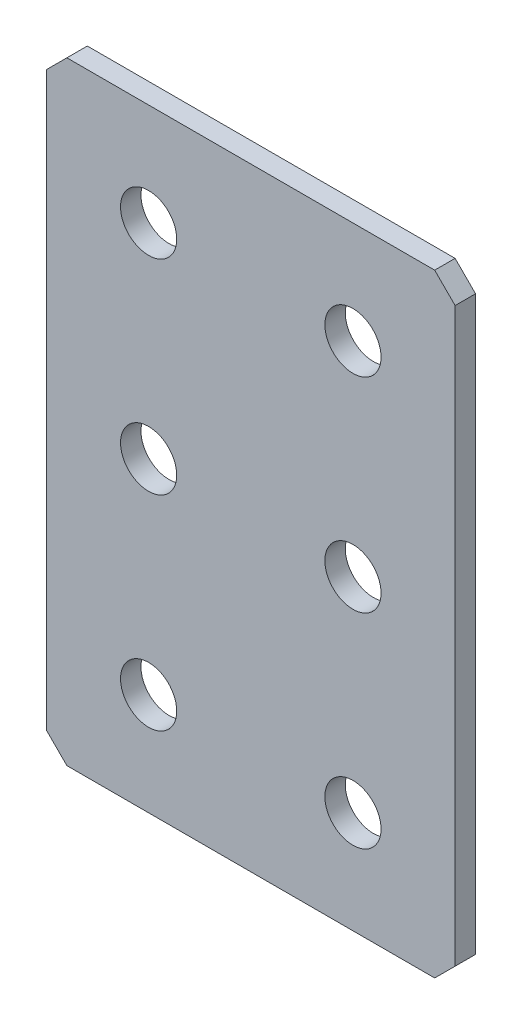
ISO-10303-21;
HEADER;
FILE_DESCRIPTION(('STEP AP214'),'2;1');
FILE_NAME('part.step','',(''),(''),'','','');
FILE_SCHEMA(('AUTOMOTIVE_DESIGN { 1 0 10303 214 1 1 1 1 }'));
ENDSEC;
DATA;
#1=APPLICATION_CONTEXT('core data for automotive mechanical design processes');
#2=APPLICATION_PROTOCOL_DEFINITION('international standard','automotive_design',2000,#1);
#3=PRODUCT_CONTEXT('',#1,'mechanical');
#4=PRODUCT('Part','Part','',(#3));
#5=PRODUCT_RELATED_PRODUCT_CATEGORY('part','',(#4));
#6=PRODUCT_DEFINITION_FORMATION('','',#4);
#7=PRODUCT_DEFINITION_CONTEXT('part definition',#1,'design');
#8=PRODUCT_DEFINITION('design','',#6,#7);
#9=PRODUCT_DEFINITION_SHAPE('','',#8);
#10=(LENGTH_UNIT() NAMED_UNIT(*) SI_UNIT(.MILLI.,.METRE.));
#11=(NAMED_UNIT(*) PLANE_ANGLE_UNIT() SI_UNIT($,.RADIAN.));
#12=(NAMED_UNIT(*) SI_UNIT($,.STERADIAN.) SOLID_ANGLE_UNIT());
#13=UNCERTAINTY_MEASURE_WITH_UNIT(LENGTH_MEASURE(1.E-05),#10,'distance_accuracy_value','');
#14=(GEOMETRIC_REPRESENTATION_CONTEXT(3) GLOBAL_UNCERTAINTY_ASSIGNED_CONTEXT((#13)) GLOBAL_UNIT_ASSIGNED_CONTEXT((#10,
#11,#12)) REPRESENTATION_CONTEXT('',''));
#15=CARTESIAN_POINT('',(0.,0.,0.));
#16=DIRECTION('',(0.,0.,1.));
#17=DIRECTION('',(1.,0.,0.));
#18=AXIS2_PLACEMENT_3D('',#15,#16,#17);
#19=CARTESIAN_POINT('',(20.,-30.,2.));
#20=DIRECTION('',(-1.,0.,0.));
#21=DIRECTION('',(0.,0.,1.));
#22=AXIS2_PLACEMENT_3D('',#19,#20,#21);
#23=PLANE('',#22);
#24=DIRECTION('',(0.,1.,0.));
#25=VECTOR('',#24,1.);
#26=CARTESIAN_POINT('',(20.,-30.,2.));
#27=LINE('',#26,#25);
#28=CARTESIAN_POINT('',(20.,-28.,2.));
#29=VERTEX_POINT('',#28);
#30=CARTESIAN_POINT('',(20.,28.,2.));
#31=VERTEX_POINT('',#30);
#32=EDGE_CURVE('E127',#29,#31,#27,.T.);
#33=ORIENTED_EDGE('',*,*,#32,.F.);
#34=DIRECTION('',(0.,0.,-1.));
#35=VECTOR('',#34,1.);
#36=CARTESIAN_POINT('',(20.,-28.,2.));
#37=LINE('',#36,#35);
#38=CARTESIAN_POINT('',(20.,-28.,0.));
#39=VERTEX_POINT('',#38);
#40=EDGE_CURVE('E153',#29,#39,#37,.T.);
#41=ORIENTED_EDGE('',*,*,#40,.T.);
#42=DIRECTION('',(0.,1.,0.));
#43=VECTOR('',#42,1.);
#44=CARTESIAN_POINT('',(20.,-30.,0.));
#45=LINE('',#44,#43);
#46=CARTESIAN_POINT('',(20.,28.,0.));
#47=VERTEX_POINT('',#46);
#48=EDGE_CURVE('E161',#39,#47,#45,.T.);
#49=ORIENTED_EDGE('',*,*,#48,.T.);
#50=DIRECTION('',(0.,0.,1.));
#51=VECTOR('',#50,1.);
#52=CARTESIAN_POINT('',(20.,28.,2.));
#53=LINE('',#52,#51);
#54=EDGE_CURVE('E151',#47,#31,#53,.T.);
#55=ORIENTED_EDGE('',*,*,#54,.T.);
#56=EDGE_LOOP('',(#33,#41,#49,#55));
#57=FACE_BOUND('',#56,.T.);
#58=ADVANCED_FACE('F36',(#57),#23,.F.);
#59=CARTESIAN_POINT('',(-20.,30.,2.));
#60=DIRECTION('',(0.,-1.,0.));
#61=DIRECTION('',(0.,0.,-1.));
#62=AXIS2_PLACEMENT_3D('',#59,#60,#61);
#63=PLANE('',#62);
#64=DIRECTION('',(-1.,0.,0.));
#65=VECTOR('',#64,1.);
#66=CARTESIAN_POINT('',(-20.,30.,0.));
#67=LINE('',#66,#65);
#68=CARTESIAN_POINT('',(18.,30.,0.));
#69=VERTEX_POINT('',#68);
#70=CARTESIAN_POINT('',(-18.,30.,0.));
#71=VERTEX_POINT('',#70);
#72=EDGE_CURVE('E132',#69,#71,#67,.T.);
#73=ORIENTED_EDGE('',*,*,#72,.T.);
#74=DIRECTION('',(0.,0.,1.));
#75=VECTOR('',#74,1.);
#76=CARTESIAN_POINT('',(-18.,30.,2.));
#77=LINE('',#76,#75);
#78=CARTESIAN_POINT('',(-18.,30.,2.));
#79=VERTEX_POINT('',#78);
#80=EDGE_CURVE('E11',#71,#79,#77,.T.);
#81=ORIENTED_EDGE('',*,*,#80,.T.);
#82=DIRECTION('',(-1.,0.,0.));
#83=VECTOR('',#82,1.);
#84=CARTESIAN_POINT('',(-20.,30.,2.));
#85=LINE('',#84,#83);
#86=CARTESIAN_POINT('',(18.,30.,2.));
#87=VERTEX_POINT('',#86);
#88=EDGE_CURVE('E130',#87,#79,#85,.T.);
#89=ORIENTED_EDGE('',*,*,#88,.F.);
#90=DIRECTION('',(0.,0.,-1.));
#91=VECTOR('',#90,1.);
#92=CARTESIAN_POINT('',(18.,30.,2.));
#93=LINE('',#92,#91);
#94=EDGE_CURVE('E44',#87,#69,#93,.T.);
#95=ORIENTED_EDGE('',*,*,#94,.T.);
#96=EDGE_LOOP('',(#73,#81,#89,#95));
#97=FACE_BOUND('',#96,.T.);
#98=ADVANCED_FACE('F158',(#97),#63,.F.);
#99=CARTESIAN_POINT('',(-20.,-30.,2.));
#100=DIRECTION('',(1.,0.,0.));
#101=DIRECTION('',(0.,0.,-1.));
#102=AXIS2_PLACEMENT_3D('',#99,#100,#101);
#103=PLANE('',#102);
#104=DIRECTION('',(0.,-1.,0.));
#105=VECTOR('',#104,1.);
#106=CARTESIAN_POINT('',(-20.,-30.,0.));
#107=LINE('',#106,#105);
#108=CARTESIAN_POINT('',(-20.,28.,0.));
#109=VERTEX_POINT('',#108);
#110=CARTESIAN_POINT('',(-20.,-28.,0.));
#111=VERTEX_POINT('',#110);
#112=EDGE_CURVE('E128',#109,#111,#107,.T.);
#113=ORIENTED_EDGE('',*,*,#112,.T.);
#114=DIRECTION('',(0.,0.,1.));
#115=VECTOR('',#114,1.);
#116=CARTESIAN_POINT('',(-20.,-28.,2.));
#117=LINE('',#116,#115);
#118=CARTESIAN_POINT('',(-20.,-28.,2.));
#119=VERTEX_POINT('',#118);
#120=EDGE_CURVE('E106',#111,#119,#117,.T.);
#121=ORIENTED_EDGE('',*,*,#120,.T.);
#122=DIRECTION('',(0.,-1.,0.));
#123=VECTOR('',#122,1.);
#124=CARTESIAN_POINT('',(-20.,-30.,2.));
#125=LINE('',#124,#123);
#126=CARTESIAN_POINT('',(-20.,28.,2.));
#127=VERTEX_POINT('',#126);
#128=EDGE_CURVE('E166',#127,#119,#125,.T.);
#129=ORIENTED_EDGE('',*,*,#128,.F.);
#130=DIRECTION('',(0.,0.,-1.));
#131=VECTOR('',#130,1.);
#132=CARTESIAN_POINT('',(-20.,28.,2.));
#133=LINE('',#132,#131);
#134=EDGE_CURVE('E111',#127,#109,#133,.T.);
#135=ORIENTED_EDGE('',*,*,#134,.T.);
#136=EDGE_LOOP('',(#113,#121,#129,#135));
#137=FACE_BOUND('',#136,.T.);
#138=ADVANCED_FACE('F225',(#137),#103,.F.);
#139=CARTESIAN_POINT('',(-20.,-30.,2.));
#140=DIRECTION('',(0.,1.,0.));
#141=DIRECTION('',(0.,0.,1.));
#142=AXIS2_PLACEMENT_3D('',#139,#140,#141);
#143=PLANE('',#142);
#144=DIRECTION('',(1.,0.,0.));
#145=VECTOR('',#144,1.);
#146=CARTESIAN_POINT('',(-20.,-30.,2.));
#147=LINE('',#146,#145);
#148=CARTESIAN_POINT('',(-18.,-30.,2.));
#149=VERTEX_POINT('',#148);
#150=CARTESIAN_POINT('',(18.,-30.,2.));
#151=VERTEX_POINT('',#150);
#152=EDGE_CURVE('E121',#149,#151,#147,.T.);
#153=ORIENTED_EDGE('',*,*,#152,.F.);
#154=DIRECTION('',(0.,0.,-1.));
#155=VECTOR('',#154,1.);
#156=CARTESIAN_POINT('',(-18.,-30.,2.));
#157=LINE('',#156,#155);
#158=CARTESIAN_POINT('',(-18.,-30.,0.));
#159=VERTEX_POINT('',#158);
#160=EDGE_CURVE('E105',#149,#159,#157,.T.);
#161=ORIENTED_EDGE('',*,*,#160,.T.);
#162=DIRECTION('',(1.,0.,0.));
#163=VECTOR('',#162,1.);
#164=CARTESIAN_POINT('',(-20.,-30.,0.));
#165=LINE('',#164,#163);
#166=CARTESIAN_POINT('',(18.,-30.,0.));
#167=VERTEX_POINT('',#166);
#168=EDGE_CURVE('E118',#159,#167,#165,.T.);
#169=ORIENTED_EDGE('',*,*,#168,.T.);
#170=DIRECTION('',(0.,0.,1.));
#171=VECTOR('',#170,1.);
#172=CARTESIAN_POINT('',(18.,-30.,2.));
#173=LINE('',#172,#171);
#174=EDGE_CURVE('E123',#167,#151,#173,.T.);
#175=ORIENTED_EDGE('',*,*,#174,.T.);
#176=EDGE_LOOP('',(#153,#161,#169,#175));
#177=FACE_BOUND('',#176,.T.);
#178=ADVANCED_FACE('F117',(#177),#143,.F.);
#179=CARTESIAN_POINT('',(0.,0.,2.));
#180=DIRECTION('',(0.,0.,-1.));
#181=DIRECTION('',(-1.,0.,0.));
#182=AXIS2_PLACEMENT_3D('',#179,#180,#181);
#183=PLANE('',#182);
#184=CARTESIAN_POINT('',(-10.,20.,2.));
#185=DIRECTION('',(0.,0.,1.));
#186=DIRECTION('',(1.,0.,0.));
#187=AXIS2_PLACEMENT_3D('',#184,#185,#186);
#188=CIRCLE('',#187,2.75);
#189=CARTESIAN_POINT('',(-7.25,20.,2.));
#190=VERTEX_POINT('',#189);
#191=EDGE_CURVE('E202',#190,#190,#188,.T.);
#192=ORIENTED_EDGE('',*,*,#191,.F.);
#193=EDGE_LOOP('',(#192));
#194=FACE_BOUND('',#193,.T.);
#195=CARTESIAN_POINT('',(10.,20.,2.));
#196=DIRECTION('',(0.,0.,1.));
#197=DIRECTION('',(1.,0.,0.));
#198=AXIS2_PLACEMENT_3D('',#195,#196,#197);
#199=CIRCLE('',#198,2.75);
#200=CARTESIAN_POINT('',(12.75,20.,2.));
#201=VERTEX_POINT('',#200);
#202=EDGE_CURVE('E196',#201,#201,#199,.T.);
#203=ORIENTED_EDGE('',*,*,#202,.F.);
#204=EDGE_LOOP('',(#203));
#205=FACE_BOUND('',#204,.T.);
#206=CARTESIAN_POINT('',(10.,0.,2.));
#207=DIRECTION('',(0.,0.,1.));
#208=DIRECTION('',(1.,0.,0.));
#209=AXIS2_PLACEMENT_3D('',#206,#207,#208);
#210=CIRCLE('',#209,2.75);
#211=CARTESIAN_POINT('',(12.75,0.,2.));
#212=VERTEX_POINT('',#211);
#213=EDGE_CURVE('E190',#212,#212,#210,.T.);
#214=ORIENTED_EDGE('',*,*,#213,.F.);
#215=EDGE_LOOP('',(#214));
#216=FACE_BOUND('',#215,.T.);
#217=CARTESIAN_POINT('',(-10.,0.,2.));
#218=DIRECTION('',(0.,0.,1.));
#219=DIRECTION('',(1.,0.,0.));
#220=AXIS2_PLACEMENT_3D('',#217,#218,#219);
#221=CIRCLE('',#220,2.75);
#222=CARTESIAN_POINT('',(-7.25,0.,2.));
#223=VERTEX_POINT('',#222);
#224=EDGE_CURVE('E184',#223,#223,#221,.T.);
#225=ORIENTED_EDGE('',*,*,#224,.F.);
#226=EDGE_LOOP('',(#225));
#227=FACE_BOUND('',#226,.T.);
#228=CARTESIAN_POINT('',(-10.,-20.,2.));
#229=DIRECTION('',(0.,0.,1.));
#230=DIRECTION('',(1.,0.,0.));
#231=AXIS2_PLACEMENT_3D('',#228,#229,#230);
#232=CIRCLE('',#231,2.75);
#233=CARTESIAN_POINT('',(-7.25,-20.,2.));
#234=VERTEX_POINT('',#233);
#235=EDGE_CURVE('E178',#234,#234,#232,.T.);
#236=ORIENTED_EDGE('',*,*,#235,.F.);
#237=EDGE_LOOP('',(#236));
#238=FACE_BOUND('',#237,.T.);
#239=CARTESIAN_POINT('',(10.,-20.,2.));
#240=DIRECTION('',(0.,0.,1.));
#241=DIRECTION('',(1.,0.,0.));
#242=AXIS2_PLACEMENT_3D('',#239,#240,#241);
#243=CIRCLE('',#242,2.75);
#244=CARTESIAN_POINT('',(12.75,-20.,2.));
#245=VERTEX_POINT('',#244);
#246=EDGE_CURVE('E172',#245,#245,#243,.T.);
#247=ORIENTED_EDGE('',*,*,#246,.F.);
#248=EDGE_LOOP('',(#247));
#249=FACE_BOUND('',#248,.T.);
#250=ORIENTED_EDGE('',*,*,#128,.T.);
#251=DIRECTION('',(-0.707106781186545,0.70710678118655,0.));
#252=VECTOR('',#251,1.);
#253=CARTESIAN_POINT('',(-18.,-30.,2.));
#254=LINE('',#253,#252);
#255=EDGE_CURVE('E149',#119,#149,#254,.F.);
#256=ORIENTED_EDGE('',*,*,#255,.T.);
#257=ORIENTED_EDGE('',*,*,#152,.T.);
#258=DIRECTION('',(-0.70710678118655,-0.707106781186545,0.));
#259=VECTOR('',#258,1.);
#260=CARTESIAN_POINT('',(20.,-28.,2.));
#261=LINE('',#260,#259);
#262=EDGE_CURVE('E147',#151,#29,#261,.F.);
#263=ORIENTED_EDGE('',*,*,#262,.T.);
#264=ORIENTED_EDGE('',*,*,#32,.T.);
#265=DIRECTION('',(0.707106781186545,-0.70710678118655,0.));
#266=VECTOR('',#265,1.);
#267=CARTESIAN_POINT('',(18.,30.,2.));
#268=LINE('',#267,#266);
#269=EDGE_CURVE('E56',#31,#87,#268,.F.);
#270=ORIENTED_EDGE('',*,*,#269,.T.);
#271=ORIENTED_EDGE('',*,*,#88,.T.);
#272=DIRECTION('',(0.70710678118655,0.707106781186545,0.));
#273=VECTOR('',#272,1.);
#274=CARTESIAN_POINT('',(-20.,28.,2.));
#275=LINE('',#274,#273);
#276=EDGE_CURVE('E145',#79,#127,#275,.F.);
#277=ORIENTED_EDGE('',*,*,#276,.T.);
#278=EDGE_LOOP('',(#250,#256,#257,#263,#264,#270,#271,#277));
#279=FACE_BOUND('',#278,.T.);
#280=ADVANCED_FACE('F208',(#194,#205,#216,#227,#238,#249,#279),#183,.F.);
#281=CARTESIAN_POINT('',(0.,0.,0.));
#282=DIRECTION('',(0.,0.,-1.));
#283=DIRECTION('',(-1.,0.,0.));
#284=AXIS2_PLACEMENT_3D('',#281,#282,#283);
#285=PLANE('',#284);
#286=CARTESIAN_POINT('',(-10.,20.,0.));
#287=DIRECTION('',(0.,0.,1.));
#288=DIRECTION('',(1.,0.,0.));
#289=AXIS2_PLACEMENT_3D('',#286,#287,#288);
#290=CIRCLE('',#289,2.75);
#291=CARTESIAN_POINT('',(-7.25,20.,0.));
#292=VERTEX_POINT('',#291);
#293=EDGE_CURVE('E199',#292,#292,#290,.T.);
#294=ORIENTED_EDGE('',*,*,#293,.T.);
#295=EDGE_LOOP('',(#294));
#296=FACE_BOUND('',#295,.T.);
#297=CARTESIAN_POINT('',(10.,20.,0.));
#298=DIRECTION('',(0.,0.,1.));
#299=DIRECTION('',(1.,0.,0.));
#300=AXIS2_PLACEMENT_3D('',#297,#298,#299);
#301=CIRCLE('',#300,2.75);
#302=CARTESIAN_POINT('',(12.75,20.,0.));
#303=VERTEX_POINT('',#302);
#304=EDGE_CURVE('E193',#303,#303,#301,.T.);
#305=ORIENTED_EDGE('',*,*,#304,.T.);
#306=EDGE_LOOP('',(#305));
#307=FACE_BOUND('',#306,.T.);
#308=CARTESIAN_POINT('',(10.,0.,0.));
#309=DIRECTION('',(0.,0.,1.));
#310=DIRECTION('',(1.,0.,0.));
#311=AXIS2_PLACEMENT_3D('',#308,#309,#310);
#312=CIRCLE('',#311,2.75);
#313=CARTESIAN_POINT('',(12.75,0.,0.));
#314=VERTEX_POINT('',#313);
#315=EDGE_CURVE('E187',#314,#314,#312,.T.);
#316=ORIENTED_EDGE('',*,*,#315,.T.);
#317=EDGE_LOOP('',(#316));
#318=FACE_BOUND('',#317,.T.);
#319=CARTESIAN_POINT('',(-10.,0.,0.));
#320=DIRECTION('',(0.,0.,1.));
#321=DIRECTION('',(1.,0.,0.));
#322=AXIS2_PLACEMENT_3D('',#319,#320,#321);
#323=CIRCLE('',#322,2.75);
#324=CARTESIAN_POINT('',(-7.25,0.,0.));
#325=VERTEX_POINT('',#324);
#326=EDGE_CURVE('E181',#325,#325,#323,.T.);
#327=ORIENTED_EDGE('',*,*,#326,.T.);
#328=EDGE_LOOP('',(#327));
#329=FACE_BOUND('',#328,.T.);
#330=CARTESIAN_POINT('',(-10.,-20.,0.));
#331=DIRECTION('',(0.,0.,1.));
#332=DIRECTION('',(1.,0.,0.));
#333=AXIS2_PLACEMENT_3D('',#330,#331,#332);
#334=CIRCLE('',#333,2.75);
#335=CARTESIAN_POINT('',(-7.25,-20.,0.));
#336=VERTEX_POINT('',#335);
#337=EDGE_CURVE('E175',#336,#336,#334,.T.);
#338=ORIENTED_EDGE('',*,*,#337,.T.);
#339=EDGE_LOOP('',(#338));
#340=FACE_BOUND('',#339,.T.);
#341=CARTESIAN_POINT('',(10.,-20.,0.));
#342=DIRECTION('',(0.,0.,1.));
#343=DIRECTION('',(1.,0.,0.));
#344=AXIS2_PLACEMENT_3D('',#341,#342,#343);
#345=CIRCLE('',#344,2.75);
#346=CARTESIAN_POINT('',(12.75,-20.,0.));
#347=VERTEX_POINT('',#346);
#348=EDGE_CURVE('E162',#347,#347,#345,.T.);
#349=ORIENTED_EDGE('',*,*,#348,.T.);
#350=EDGE_LOOP('',(#349));
#351=FACE_BOUND('',#350,.T.);
#352=ORIENTED_EDGE('',*,*,#168,.F.);
#353=DIRECTION('',(0.707106781186545,-0.70710678118655,0.));
#354=VECTOR('',#353,1.);
#355=CARTESIAN_POINT('',(-24.0000000000001,-23.9999999999999,0.));
#356=LINE('',#355,#354);
#357=EDGE_CURVE('E101',#159,#111,#356,.F.);
#358=ORIENTED_EDGE('',*,*,#357,.T.);
#359=ORIENTED_EDGE('',*,*,#112,.F.);
#360=DIRECTION('',(-0.70710678118655,-0.707106781186545,0.));
#361=VECTOR('',#360,1.);
#362=CARTESIAN_POINT('',(-23.9999999999999,24.0000000000001,0.));
#363=LINE('',#362,#361);
#364=EDGE_CURVE('E138',#109,#71,#363,.F.);
#365=ORIENTED_EDGE('',*,*,#364,.T.);
#366=ORIENTED_EDGE('',*,*,#72,.F.);
#367=DIRECTION('',(-0.707106781186545,0.70710678118655,0.));
#368=VECTOR('',#367,1.);
#369=CARTESIAN_POINT('',(24.0000000000001,23.9999999999999,0.));
#370=LINE('',#369,#368);
#371=EDGE_CURVE('E122',#69,#47,#370,.F.);
#372=ORIENTED_EDGE('',*,*,#371,.T.);
#373=ORIENTED_EDGE('',*,*,#48,.F.);
#374=DIRECTION('',(0.70710678118655,0.707106781186545,0.));
#375=VECTOR('',#374,1.);
#376=CARTESIAN_POINT('',(23.9999999999999,-24.0000000000001,0.));
#377=LINE('',#376,#375);
#378=EDGE_CURVE('E112',#39,#167,#377,.F.);
#379=ORIENTED_EDGE('',*,*,#378,.T.);
#380=EDGE_LOOP('',(#352,#358,#359,#365,#366,#372,#373,#379));
#381=FACE_BOUND('',#380,.T.);
#382=ADVANCED_FACE('F125',(#296,#307,#318,#329,#340,#351,#381),#285,.T.);
#383=CARTESIAN_POINT('',(-18.,-30.,2.));
#384=DIRECTION('',(0.70710678118655,0.707106781186545,0.));
#385=DIRECTION('',(0.,0.,-1.));
#386=AXIS2_PLACEMENT_3D('',#383,#384,#385);
#387=PLANE('',#386);
#388=ORIENTED_EDGE('',*,*,#255,.F.);
#389=ORIENTED_EDGE('',*,*,#120,.F.);
#390=ORIENTED_EDGE('',*,*,#357,.F.);
#391=ORIENTED_EDGE('',*,*,#160,.F.);
#392=EDGE_LOOP('',(#388,#389,#390,#391));
#393=FACE_BOUND('',#392,.T.);
#394=ADVANCED_FACE('F104',(#393),#387,.F.);
#395=CARTESIAN_POINT('',(20.,-28.,2.));
#396=DIRECTION('',(-0.707106781186545,0.70710678118655,0.));
#397=DIRECTION('',(0.,0.,-1.));
#398=AXIS2_PLACEMENT_3D('',#395,#396,#397);
#399=PLANE('',#398);
#400=ORIENTED_EDGE('',*,*,#262,.F.);
#401=ORIENTED_EDGE('',*,*,#174,.F.);
#402=ORIENTED_EDGE('',*,*,#378,.F.);
#403=ORIENTED_EDGE('',*,*,#40,.F.);
#404=EDGE_LOOP('',(#400,#401,#402,#403));
#405=FACE_BOUND('',#404,.T.);
#406=ADVANCED_FACE('F229',(#405),#399,.F.);
#407=CARTESIAN_POINT('',(-20.,28.,2.));
#408=DIRECTION('',(0.707106781186545,-0.70710678118655,0.));
#409=DIRECTION('',(0.,0.,-1.));
#410=AXIS2_PLACEMENT_3D('',#407,#408,#409);
#411=PLANE('',#410);
#412=ORIENTED_EDGE('',*,*,#276,.F.);
#413=ORIENTED_EDGE('',*,*,#80,.F.);
#414=ORIENTED_EDGE('',*,*,#364,.F.);
#415=ORIENTED_EDGE('',*,*,#134,.F.);
#416=EDGE_LOOP('',(#412,#413,#414,#415));
#417=FACE_BOUND('',#416,.T.);
#418=ADVANCED_FACE('F227',(#417),#411,.F.);
#419=CARTESIAN_POINT('',(18.,30.,2.));
#420=DIRECTION('',(-0.70710678118655,-0.707106781186545,0.));
#421=DIRECTION('',(0.,0.,-1.));
#422=AXIS2_PLACEMENT_3D('',#419,#420,#421);
#423=PLANE('',#422);
#424=ORIENTED_EDGE('',*,*,#269,.F.);
#425=ORIENTED_EDGE('',*,*,#54,.F.);
#426=ORIENTED_EDGE('',*,*,#371,.F.);
#427=ORIENTED_EDGE('',*,*,#94,.F.);
#428=EDGE_LOOP('',(#424,#425,#426,#427));
#429=FACE_BOUND('',#428,.T.);
#430=ADVANCED_FACE('F38',(#429),#423,.F.);
#431=CARTESIAN_POINT('',(10.,-20.,2.));
#432=DIRECTION('',(0.,0.,1.));
#433=DIRECTION('',(1.,0.,0.));
#434=AXIS2_PLACEMENT_3D('',#431,#432,#433);
#435=CYLINDRICAL_SURFACE('',#434,2.75);
#436=ORIENTED_EDGE('',*,*,#348,.F.);
#437=EDGE_LOOP('',(#436));
#438=FACE_BOUND('',#437,.T.);
#439=ORIENTED_EDGE('',*,*,#246,.T.);
#440=EDGE_LOOP('',(#439));
#441=FACE_BOUND('',#440,.T.);
#442=ADVANCED_FACE('F234',(#438,#441),#435,.F.);
#443=CARTESIAN_POINT('',(-10.,-20.,2.));
#444=DIRECTION('',(0.,0.,1.));
#445=DIRECTION('',(1.,0.,0.));
#446=AXIS2_PLACEMENT_3D('',#443,#444,#445);
#447=CYLINDRICAL_SURFACE('',#446,2.75);
#448=ORIENTED_EDGE('',*,*,#337,.F.);
#449=EDGE_LOOP('',(#448));
#450=FACE_BOUND('',#449,.T.);
#451=ORIENTED_EDGE('',*,*,#235,.T.);
#452=EDGE_LOOP('',(#451));
#453=FACE_BOUND('',#452,.T.);
#454=ADVANCED_FACE('F289',(#450,#453),#447,.F.);
#455=CARTESIAN_POINT('',(-10.,0.,2.));
#456=DIRECTION('',(0.,0.,1.));
#457=DIRECTION('',(1.,0.,0.));
#458=AXIS2_PLACEMENT_3D('',#455,#456,#457);
#459=CYLINDRICAL_SURFACE('',#458,2.75);
#460=ORIENTED_EDGE('',*,*,#326,.F.);
#461=EDGE_LOOP('',(#460));
#462=FACE_BOUND('',#461,.T.);
#463=ORIENTED_EDGE('',*,*,#224,.T.);
#464=EDGE_LOOP('',(#463));
#465=FACE_BOUND('',#464,.T.);
#466=ADVANCED_FACE('F298',(#462,#465),#459,.F.);
#467=CARTESIAN_POINT('',(10.,0.,2.));
#468=DIRECTION('',(0.,0.,1.));
#469=DIRECTION('',(1.,0.,0.));
#470=AXIS2_PLACEMENT_3D('',#467,#468,#469);
#471=CYLINDRICAL_SURFACE('',#470,2.75);
#472=ORIENTED_EDGE('',*,*,#315,.F.);
#473=EDGE_LOOP('',(#472));
#474=FACE_BOUND('',#473,.T.);
#475=ORIENTED_EDGE('',*,*,#213,.T.);
#476=EDGE_LOOP('',(#475));
#477=FACE_BOUND('',#476,.T.);
#478=ADVANCED_FACE('F308',(#474,#477),#471,.F.);
#479=CARTESIAN_POINT('',(10.,20.,2.));
#480=DIRECTION('',(0.,0.,1.));
#481=DIRECTION('',(1.,0.,0.));
#482=AXIS2_PLACEMENT_3D('',#479,#480,#481);
#483=CYLINDRICAL_SURFACE('',#482,2.75);
#484=ORIENTED_EDGE('',*,*,#304,.F.);
#485=EDGE_LOOP('',(#484));
#486=FACE_BOUND('',#485,.T.);
#487=ORIENTED_EDGE('',*,*,#202,.T.);
#488=EDGE_LOOP('',(#487));
#489=FACE_BOUND('',#488,.T.);
#490=ADVANCED_FACE('F318',(#486,#489),#483,.F.);
#491=CARTESIAN_POINT('',(-10.,20.,2.));
#492=DIRECTION('',(0.,0.,1.));
#493=DIRECTION('',(1.,0.,0.));
#494=AXIS2_PLACEMENT_3D('',#491,#492,#493);
#495=CYLINDRICAL_SURFACE('',#494,2.75);
#496=ORIENTED_EDGE('',*,*,#293,.F.);
#497=EDGE_LOOP('',(#496));
#498=FACE_BOUND('',#497,.T.);
#499=ORIENTED_EDGE('',*,*,#191,.T.);
#500=EDGE_LOOP('',(#499));
#501=FACE_BOUND('',#500,.T.);
#502=ADVANCED_FACE('F206',(#498,#501),#495,.F.);
#503=CLOSED_SHELL('',(#58,#98,#138,#178,#280,#382,#394,#406,#418,#430,#442,#454,#466,#478,#490,#502));
#504=MANIFOLD_SOLID_BREP('B2',#503);
#505=ADVANCED_BREP_SHAPE_REPRESENTATION('',(#18,#504),#14);
#506=SHAPE_DEFINITION_REPRESENTATION(#9,#505);
ENDSEC;
END-ISO-10303-21;
